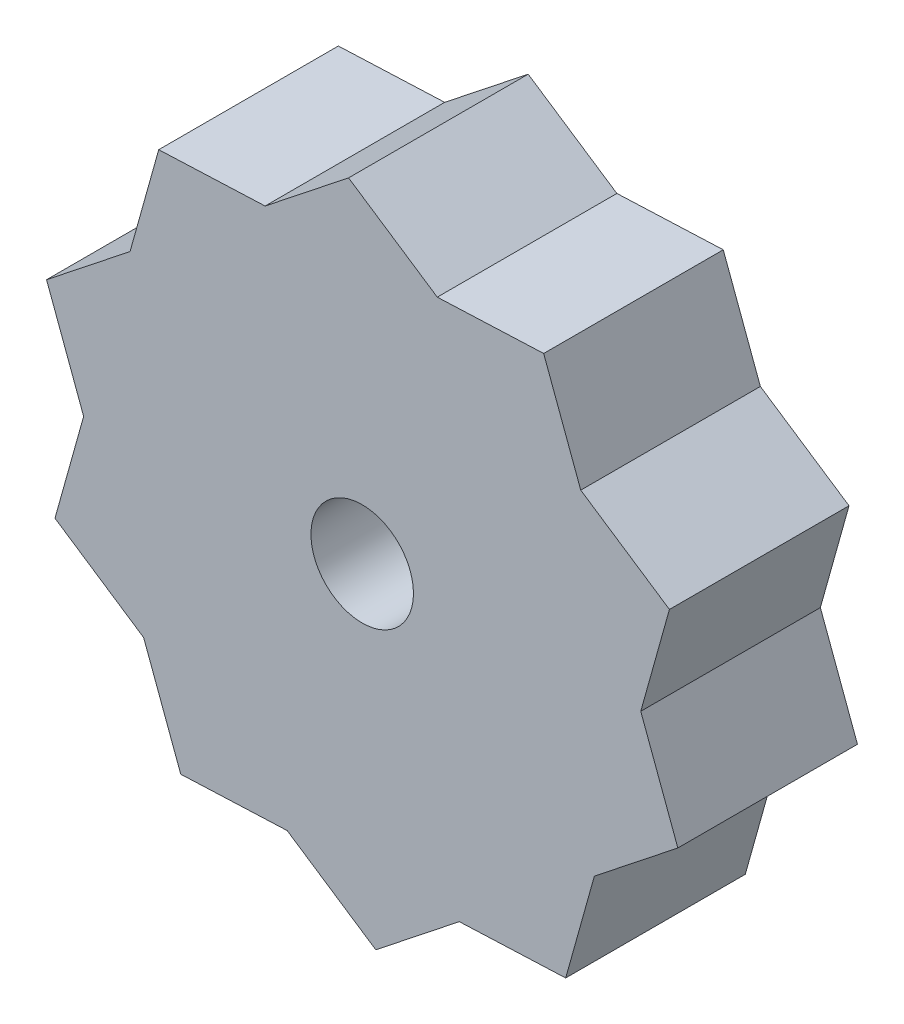
ISO-10303-21;
HEADER;
FILE_DESCRIPTION(('STEP AP214'),'2;1');
FILE_NAME('part.step','',(''),(''),'','','');
FILE_SCHEMA(('AUTOMOTIVE_DESIGN { 1 0 10303 214 1 1 1 1 }'));
ENDSEC;
DATA;
#1=APPLICATION_CONTEXT('core data for automotive mechanical design processes');
#2=APPLICATION_PROTOCOL_DEFINITION('international standard','automotive_design',2000,#1);
#3=PRODUCT_CONTEXT('',#1,'mechanical');
#4=PRODUCT('Part','Part','',(#3));
#5=PRODUCT_RELATED_PRODUCT_CATEGORY('part','',(#4));
#6=PRODUCT_DEFINITION_FORMATION('','',#4);
#7=PRODUCT_DEFINITION_CONTEXT('part definition',#1,'design');
#8=PRODUCT_DEFINITION('design','',#6,#7);
#9=PRODUCT_DEFINITION_SHAPE('','',#8);
#10=(LENGTH_UNIT() NAMED_UNIT(*) SI_UNIT(.MILLI.,.METRE.));
#11=(NAMED_UNIT(*) PLANE_ANGLE_UNIT() SI_UNIT($,.RADIAN.));
#12=(NAMED_UNIT(*) SI_UNIT($,.STERADIAN.) SOLID_ANGLE_UNIT());
#13=UNCERTAINTY_MEASURE_WITH_UNIT(LENGTH_MEASURE(1.E-05),#10,'distance_accuracy_value','');
#14=(GEOMETRIC_REPRESENTATION_CONTEXT(3) GLOBAL_UNCERTAINTY_ASSIGNED_CONTEXT((#13)) GLOBAL_UNIT_ASSIGNED_CONTEXT((#10,
#11,#12)) REPRESENTATION_CONTEXT('',''));
#15=CARTESIAN_POINT('',(0.,0.,0.));
#16=DIRECTION('',(0.,0.,1.));
#17=DIRECTION('',(1.,0.,0.));
#18=AXIS2_PLACEMENT_3D('',#15,#16,#17);
#19=CARTESIAN_POINT('',(0.,0.,0.));
#20=DIRECTION('',(0.,0.,1.));
#21=DIRECTION('',(1.,0.,0.));
#22=AXIS2_PLACEMENT_3D('',#19,#20,#21);
#23=PLANE('',#22);
#24=CARTESIAN_POINT('',(0.,0.,0.));
#25=DIRECTION('',(0.,0.,1.));
#26=DIRECTION('',(1.,0.,0.));
#27=AXIS2_PLACEMENT_3D('',#24,#25,#26);
#28=CIRCLE('',#27,1.45);
#29=CARTESIAN_POINT('',(1.45,0.,0.));
#30=VERTEX_POINT('',#29);
#31=EDGE_CURVE('E206',#30,#30,#28,.T.);
#32=ORIENTED_EDGE('',*,*,#31,.T.);
#33=EDGE_LOOP('',(#32));
#34=FACE_BOUND('',#33,.T.);
#35=DIRECTION('',(-0.783908535104401,-0.62087632310346,0.));
#36=VECTOR('',#35,1.);
#37=CARTESIAN_POINT('',(-4.65657242327595,5.87931401328301,0.));
#38=LINE('',#37,#36);
#39=CARTESIAN_POINT('',(-6.56687734652975,4.36630191602564,0.));
#40=VERTEX_POINT('',#39);
#41=CARTESIAN_POINT('',(-8.92814408942393,2.49611611303605,0.));
#42=VERTEX_POINT('',#41);
#43=EDGE_CURVE('E324',#40,#42,#38,.T.);
#44=ORIENTED_EDGE('',*,*,#43,.F.);
#45=DIRECTION('',(-0.269253380717237,-0.963069372876294,0.));
#46=VECTOR('',#45,1.);
#47=CARTESIAN_POINT('',(-7.22302029657221,2.01940035537928,0.));
#48=LINE('',#47,#46);
#49=CARTESIAN_POINT('',(-5.75584005732002,7.26723178148488,0.));
#50=VERTEX_POINT('',#49);
#51=EDGE_CURVE('E320',#50,#40,#48,.T.);
#52=ORIENTED_EDGE('',*,*,#51,.F.);
#53=DIRECTION('',(-0.999137273152821,-0.041529620715171,0.));
#54=VECTOR('',#53,1.);
#55=CARTESIAN_POINT('',(-0.311472155363783,7.49352954864616,0.));
#56=LINE('',#55,#54);
#57=CARTESIAN_POINT('',(-2.74626750002217,7.39232611054035,0.));
#58=VERTEX_POINT('',#57);
#59=EDGE_CURVE('E316',#58,#50,#56,.T.);
#60=ORIENTED_EDGE('',*,*,#59,.F.);
#61=DIRECTION('',(-0.783908535104401,-0.62087632310346,0.));
#62=VECTOR('',#61,1.);
#63=CARTESIAN_POINT('',(-4.65657242327595,5.87931401328301,0.));
#64=LINE('',#63,#62);
#65=CARTESIAN_POINT('',(-0.385000757127965,9.26251191352996,0.));
#66=VERTEX_POINT('',#65);
#67=EDGE_CURVE('E312',#66,#58,#64,.T.);
#68=ORIENTED_EDGE('',*,*,#67,.F.);
#69=DIRECTION('',(-0.832729532283751,0.553679985246429,0.));
#70=VECTOR('',#69,1.);
#71=CARTESIAN_POINT('',(4.15259988934822,6.24547149212813,0.));
#72=LINE('',#71,#70);
#73=CARTESIAN_POINT('',(2.12332318929464,7.59473298675197,0.));
#74=VERTEX_POINT('',#73);
#75=EDGE_CURVE('E308',#74,#66,#72,.T.);
#76=ORIENTED_EDGE('',*,*,#75,.F.);
#77=DIRECTION('',(-0.999137273152821,-0.041529620715171,0.));
#78=VECTOR('',#77,1.);
#79=CARTESIAN_POINT('',(-0.311472155363783,7.49352954864616,0.));
#80=LINE('',#79,#78);
#81=CARTESIAN_POINT('',(5.13289574659245,7.71982731580744,0.));
#82=VERTEX_POINT('',#81);
#83=EDGE_CURVE('E304',#82,#74,#80,.T.);
#84=ORIENTED_EDGE('',*,*,#83,.F.);
#85=DIRECTION('',(-0.348247413518095,0.937402655734427,0.));
#86=VECTOR('',#85,1.);
#87=CARTESIAN_POINT('',(7.03051991800819,2.61185560138571,0.));
#88=LINE('',#87,#86);
#89=CARTESIAN_POINT('',(6.18187658940173,4.89620999750433,0.));
#90=VERTEX_POINT('',#89);
#91=EDGE_CURVE('E300',#90,#82,#88,.T.);
#92=ORIENTED_EDGE('',*,*,#91,.F.);
#93=DIRECTION('',(-0.832729532283751,0.553679985246429,0.));
#94=VECTOR('',#93,1.);
#95=CARTESIAN_POINT('',(4.15259988934822,6.24547149212813,0.));
#96=LINE('',#95,#94);
#97=CARTESIAN_POINT('',(8.6902005358244,3.22843107072629,0.));
#98=VERTEX_POINT('',#97);
#99=EDGE_CURVE('E296',#98,#90,#96,.T.);
#100=ORIENTED_EDGE('',*,*,#99,.F.);
#101=DIRECTION('',(0.269253380717241,0.963069372876293,0.));
#102=VECTOR('',#101,1.);
#103=CARTESIAN_POINT('',(7.2230202965722,-2.0194003553793,0.));
#104=LINE('',#103,#102);
#105=CARTESIAN_POINT('',(7.87916324661466,0.327501205267048,0.));
#106=VERTEX_POINT('',#105);
#107=EDGE_CURVE('E292',#106,#98,#104,.T.);
#108=ORIENTED_EDGE('',*,*,#107,.F.);
#109=DIRECTION('',(-0.348247413518095,0.937402655734427,0.));
#110=VECTOR('',#109,1.);
#111=CARTESIAN_POINT('',(7.03051991800819,2.61185560138571,0.));
#112=LINE('',#111,#110);
#113=CARTESIAN_POINT('',(8.92814408942393,-2.49611611303602,0.));
#114=VERTEX_POINT('',#113);
#115=EDGE_CURVE('E288',#114,#106,#112,.T.);
#116=ORIENTED_EDGE('',*,*,#115,.F.);
#117=DIRECTION('',(0.783908535104399,0.620876323103463,0.));
#118=VECTOR('',#117,1.);
#119=CARTESIAN_POINT('',(4.65657242327597,-5.87931401328299,0.));
#120=LINE('',#119,#118);
#121=CARTESIAN_POINT('',(6.56687734652974,-4.36630191602564,0.));
#122=VERTEX_POINT('',#121);
#123=EDGE_CURVE('E284',#122,#114,#120,.T.);
#124=ORIENTED_EDGE('',*,*,#123,.F.);
#125=DIRECTION('',(0.269253380717241,0.963069372876293,0.));
#126=VECTOR('',#125,1.);
#127=CARTESIAN_POINT('',(7.2230202965722,-2.0194003553793,0.));
#128=LINE('',#127,#126);
#129=CARTESIAN_POINT('',(5.75584005732,-7.2672317814849,0.));
#130=VERTEX_POINT('',#129);
#131=EDGE_CURVE('E280',#130,#122,#128,.T.);
#132=ORIENTED_EDGE('',*,*,#131,.F.);
#133=DIRECTION('',(0.999137273152821,0.0415296207151665,0.));
#134=VECTOR('',#133,1.);
#135=CARTESIAN_POINT('',(0.311472155363748,-7.49352954864615,0.));
#136=LINE('',#135,#134);
#137=CARTESIAN_POINT('',(2.74626750002218,-7.39232611054036,0.));
#138=VERTEX_POINT('',#137);
#139=EDGE_CURVE('E276',#138,#130,#136,.T.);
#140=ORIENTED_EDGE('',*,*,#139,.F.);
#141=DIRECTION('',(0.783908535104399,0.620876323103463,0.));
#142=VECTOR('',#141,1.);
#143=CARTESIAN_POINT('',(4.65657242327597,-5.87931401328299,0.));
#144=LINE('',#143,#142);
#145=CARTESIAN_POINT('',(0.385000757128001,-9.26251191352997,0.));
#146=VERTEX_POINT('',#145);
#147=EDGE_CURVE('E273',#146,#138,#144,.T.);
#148=ORIENTED_EDGE('',*,*,#147,.F.);
#149=DIRECTION('',(0.832729532283753,-0.553679985246426,0.));
#150=VECTOR('',#149,1.);
#151=CARTESIAN_POINT('',(-4.1525998893482,-6.24547149212815,0.));
#152=LINE('',#151,#150);
#153=CARTESIAN_POINT('',(-2.12332318929466,-7.59473298675195,0.));
#154=VERTEX_POINT('',#153);
#155=EDGE_CURVE('E160',#154,#146,#152,.T.);
#156=ORIENTED_EDGE('',*,*,#155,.F.);
#157=DIRECTION('',(0.999137273152821,0.0415296207151665,0.));
#158=VECTOR('',#157,1.);
#159=CARTESIAN_POINT('',(-5.1328957465925,-7.71982731580741,0.));
#160=LINE('',#159,#158);
#161=CARTESIAN_POINT('',(-5.1328957465925,-7.71982731580741,0.));
#162=VERTEX_POINT('',#161);
#163=EDGE_CURVE('E153',#162,#154,#160,.T.);
#164=ORIENTED_EDGE('',*,*,#163,.F.);
#165=DIRECTION('',(0.348247413518091,-0.937402655734429,0.));
#166=VECTOR('',#165,1.);
#167=CARTESIAN_POINT('',(-8.92814408942393,2.49611611303605,0.));
#168=LINE('',#167,#166);
#169=CARTESIAN_POINT('',(-6.18187658940176,-4.89620999750433,0.));
#170=VERTEX_POINT('',#169);
#171=EDGE_CURVE('E144',#170,#162,#168,.T.);
#172=ORIENTED_EDGE('',*,*,#171,.F.);
#173=CARTESIAN_POINT('',(-8.69020053582439,-3.22843107072633,0.));
#174=VERTEX_POINT('',#173);
#175=EDGE_CURVE('E270',#174,#170,#152,.T.);
#176=ORIENTED_EDGE('',*,*,#175,.F.);
#177=DIRECTION('',(-0.269253380717237,-0.963069372876294,0.));
#178=VECTOR('',#177,1.);
#179=CARTESIAN_POINT('',(-7.22302029657221,2.01940035537928,0.));
#180=LINE('',#179,#178);
#181=CARTESIAN_POINT('',(-7.87916324661466,-0.327501205267067,0.));
#182=VERTEX_POINT('',#181);
#183=EDGE_CURVE('E196',#182,#174,#180,.T.);
#184=ORIENTED_EDGE('',*,*,#183,.F.);
#185=DIRECTION('',(0.348247413518091,-0.937402655734429,0.));
#186=VECTOR('',#185,1.);
#187=CARTESIAN_POINT('',(-7.03051991800822,-2.61185560138568,0.));
#188=LINE('',#187,#186);
#189=EDGE_CURVE('E202',#42,#182,#188,.T.);
#190=ORIENTED_EDGE('',*,*,#189,.F.);
#191=EDGE_LOOP('',(#44,#52,#60,#68,#76,#84,#92,#100,#108,#116,#124,#132,#140,#148,#156,#164,
#172,#176,#184,#190));
#192=FACE_BOUND('',#191,.T.);
#193=ADVANCED_FACE('F107',(#34,#192),#23,.F.);
#194=CARTESIAN_POINT('',(4.15259988934822,6.24547149212813,5.08));
#195=DIRECTION('',(-0.553679985246429,-0.832729532283751,0.));
#196=DIRECTION('',(0.832729532283751,-0.553679985246429,0.));
#197=AXIS2_PLACEMENT_3D('',#194,#195,#196);
#198=PLANE('',#197);
#199=ORIENTED_EDGE('',*,*,#99,.T.);
#200=DIRECTION('',(0.,0.,-1.));
#201=VECTOR('',#200,1.);
#202=CARTESIAN_POINT('',(6.18187658940173,4.89620999750433,5.08));
#203=LINE('',#202,#201);
#204=CARTESIAN_POINT('',(6.18187658940173,4.89620999750433,5.08));
#205=VERTEX_POINT('',#204);
#206=EDGE_CURVE('E366',#205,#90,#203,.T.);
#207=ORIENTED_EDGE('',*,*,#206,.F.);
#208=DIRECTION('',(-0.832729532283751,0.553679985246429,0.));
#209=VECTOR('',#208,1.);
#210=CARTESIAN_POINT('',(4.15259988934822,6.24547149212813,5.08));
#211=LINE('',#210,#209);
#212=CARTESIAN_POINT('',(8.6902005358244,3.22843107072629,5.08));
#213=VERTEX_POINT('',#212);
#214=EDGE_CURVE('E230',#213,#205,#211,.T.);
#215=ORIENTED_EDGE('',*,*,#214,.F.);
#216=DIRECTION('',(0.,0.,-1.));
#217=VECTOR('',#216,1.);
#218=CARTESIAN_POINT('',(8.6902005358244,3.22843107072629,5.08));
#219=LINE('',#218,#217);
#220=EDGE_CURVE('E370',#213,#98,#219,.T.);
#221=ORIENTED_EDGE('',*,*,#220,.T.);
#222=EDGE_LOOP('',(#199,#207,#215,#221));
#223=FACE_BOUND('',#222,.T.);
#224=ADVANCED_FACE('F432',(#223),#198,.F.);
#225=CARTESIAN_POINT('',(4.15259988934822,6.24547149212813,5.08));
#226=DIRECTION('',(-0.553679985246429,-0.832729532283751,0.));
#227=DIRECTION('',(0.832729532283751,-0.553679985246429,0.));
#228=AXIS2_PLACEMENT_3D('',#225,#226,#227);
#229=PLANE('',#228);
#230=ORIENTED_EDGE('',*,*,#75,.T.);
#231=DIRECTION('',(0.,0.,-1.));
#232=VECTOR('',#231,1.);
#233=CARTESIAN_POINT('',(-0.385000757127965,9.26251191352996,5.08));
#234=LINE('',#233,#232);
#235=CARTESIAN_POINT('',(-0.385000757127965,9.26251191352996,5.08));
#236=VERTEX_POINT('',#235);
#237=EDGE_CURVE('E354',#236,#66,#234,.T.);
#238=ORIENTED_EDGE('',*,*,#237,.F.);
#239=DIRECTION('',(-0.832729532283751,0.553679985246429,0.));
#240=VECTOR('',#239,1.);
#241=CARTESIAN_POINT('',(4.15259988934822,6.24547149212813,5.08));
#242=LINE('',#241,#240);
#243=CARTESIAN_POINT('',(2.12332318929464,7.59473298675197,5.08));
#244=VERTEX_POINT('',#243);
#245=EDGE_CURVE('E242',#244,#236,#242,.T.);
#246=ORIENTED_EDGE('',*,*,#245,.F.);
#247=DIRECTION('',(0.,0.,-1.));
#248=VECTOR('',#247,1.);
#249=CARTESIAN_POINT('',(2.12332318929464,7.59473298675197,5.08));
#250=LINE('',#249,#248);
#251=EDGE_CURVE('E358',#244,#74,#250,.T.);
#252=ORIENTED_EDGE('',*,*,#251,.T.);
#253=EDGE_LOOP('',(#230,#238,#246,#252));
#254=FACE_BOUND('',#253,.T.);
#255=ADVANCED_FACE('F454',(#254),#229,.F.);
#256=CARTESIAN_POINT('',(7.2230202965722,-2.0194003553793,5.08));
#257=DIRECTION('',(-0.963069372876293,0.269253380717241,0.));
#258=DIRECTION('',(-0.269253380717241,-0.963069372876293,0.));
#259=AXIS2_PLACEMENT_3D('',#256,#257,#258);
#260=PLANE('',#259);
#261=ORIENTED_EDGE('',*,*,#131,.T.);
#262=DIRECTION('',(0.,0.,-1.));
#263=VECTOR('',#262,1.);
#264=CARTESIAN_POINT('',(6.56687734652974,-4.36630191602564,5.08));
#265=LINE('',#264,#263);
#266=CARTESIAN_POINT('',(6.56687734652974,-4.36630191602564,5.08));
#267=VERTEX_POINT('',#266);
#268=EDGE_CURVE('E382',#267,#122,#265,.T.);
#269=ORIENTED_EDGE('',*,*,#268,.F.);
#270=DIRECTION('',(0.269253380717241,0.963069372876293,0.));
#271=VECTOR('',#270,1.);
#272=CARTESIAN_POINT('',(7.2230202965722,-2.0194003553793,5.08));
#273=LINE('',#272,#271);
#274=CARTESIAN_POINT('',(5.75584005732,-7.2672317814849,5.08));
#275=VERTEX_POINT('',#274);
#276=EDGE_CURVE('E214',#275,#267,#273,.T.);
#277=ORIENTED_EDGE('',*,*,#276,.F.);
#278=DIRECTION('',(0.,0.,-1.));
#279=VECTOR('',#278,1.);
#280=CARTESIAN_POINT('',(5.75584005732,-7.2672317814849,5.08));
#281=LINE('',#280,#279);
#282=EDGE_CURVE('E181',#275,#130,#281,.T.);
#283=ORIENTED_EDGE('',*,*,#282,.T.);
#284=EDGE_LOOP('',(#261,#269,#277,#283));
#285=FACE_BOUND('',#284,.T.);
#286=ADVANCED_FACE('F392',(#285),#260,.F.);
#287=CARTESIAN_POINT('',(7.2230202965722,-2.0194003553793,5.08));
#288=DIRECTION('',(-0.963069372876293,0.269253380717241,0.));
#289=DIRECTION('',(-0.269253380717241,-0.963069372876293,0.));
#290=AXIS2_PLACEMENT_3D('',#287,#288,#289);
#291=PLANE('',#290);
#292=ORIENTED_EDGE('',*,*,#107,.T.);
#293=ORIENTED_EDGE('',*,*,#220,.F.);
#294=DIRECTION('',(0.269253380717241,0.963069372876293,0.));
#295=VECTOR('',#294,1.);
#296=CARTESIAN_POINT('',(7.2230202965722,-2.0194003553793,5.08));
#297=LINE('',#296,#295);
#298=CARTESIAN_POINT('',(7.87916324661466,0.327501205267048,5.08));
#299=VERTEX_POINT('',#298);
#300=EDGE_CURVE('E226',#299,#213,#297,.T.);
#301=ORIENTED_EDGE('',*,*,#300,.F.);
#302=DIRECTION('',(0.,0.,-1.));
#303=VECTOR('',#302,1.);
#304=CARTESIAN_POINT('',(7.87916324661466,0.327501205267048,5.08));
#305=LINE('',#304,#303);
#306=EDGE_CURVE('E374',#299,#106,#305,.T.);
#307=ORIENTED_EDGE('',*,*,#306,.T.);
#308=EDGE_LOOP('',(#292,#293,#301,#307));
#309=FACE_BOUND('',#308,.T.);
#310=ADVANCED_FACE('F424',(#309),#291,.F.);
#311=CARTESIAN_POINT('',(0.311472155363748,-7.49352954864615,5.08));
#312=DIRECTION('',(-0.0415296207151665,0.999137273152821,0.));
#313=DIRECTION('',(-0.999137273152821,-0.0415296207151665,0.));
#314=AXIS2_PLACEMENT_3D('',#311,#312,#313);
#315=PLANE('',#314);
#316=ORIENTED_EDGE('',*,*,#139,.T.);
#317=ORIENTED_EDGE('',*,*,#282,.F.);
#318=DIRECTION('',(0.999137273152821,0.0415296207151665,0.));
#319=VECTOR('',#318,1.);
#320=CARTESIAN_POINT('',(0.311472155363748,-7.49352954864615,5.08));
#321=LINE('',#320,#319);
#322=CARTESIAN_POINT('',(2.74626750002218,-7.39232611054036,5.08));
#323=VERTEX_POINT('',#322);
#324=EDGE_CURVE('E210',#323,#275,#321,.T.);
#325=ORIENTED_EDGE('',*,*,#324,.F.);
#326=DIRECTION('',(0.,0.,-1.));
#327=VECTOR('',#326,1.);
#328=CARTESIAN_POINT('',(2.74626750002218,-7.39232611054036,5.08));
#329=LINE('',#328,#327);
#330=EDGE_CURVE('E173',#323,#138,#329,.T.);
#331=ORIENTED_EDGE('',*,*,#330,.T.);
#332=EDGE_LOOP('',(#316,#317,#325,#331));
#333=FACE_BOUND('',#332,.T.);
#334=ADVANCED_FACE('F530',(#333),#315,.F.);
#335=CARTESIAN_POINT('',(-7.03051991800822,-2.61185560138568,5.08));
#336=DIRECTION('',(0.937402655734429,0.348247413518091,0.));
#337=DIRECTION('',(-0.348247413518091,0.937402655734429,0.));
#338=AXIS2_PLACEMENT_3D('',#335,#336,#337);
#339=PLANE('',#338);
#340=ORIENTED_EDGE('',*,*,#189,.T.);
#341=DIRECTION('',(0.,0.,-1.));
#342=VECTOR('',#341,1.);
#343=CARTESIAN_POINT('',(-7.87916324661466,-0.327501205267067,5.08));
#344=LINE('',#343,#342);
#345=CARTESIAN_POINT('',(-7.87916324661466,-0.327501205267067,5.08));
#346=VERTEX_POINT('',#345);
#347=EDGE_CURVE('E334',#346,#182,#344,.T.);
#348=ORIENTED_EDGE('',*,*,#347,.F.);
#349=DIRECTION('',(0.348247413518091,-0.937402655734429,0.));
#350=VECTOR('',#349,1.);
#351=CARTESIAN_POINT('',(-7.03051991800822,-2.61185560138568,5.08));
#352=LINE('',#351,#350);
#353=CARTESIAN_POINT('',(-8.92814408942393,2.49611611303605,5.08));
#354=VERTEX_POINT('',#353);
#355=EDGE_CURVE('E261',#354,#346,#352,.T.);
#356=ORIENTED_EDGE('',*,*,#355,.F.);
#357=DIRECTION('',(0.,0.,-1.));
#358=VECTOR('',#357,1.);
#359=CARTESIAN_POINT('',(-8.92814408942393,2.49611611303605,5.08));
#360=LINE('',#359,#358);
#361=EDGE_CURVE('E338',#354,#42,#360,.T.);
#362=ORIENTED_EDGE('',*,*,#361,.T.);
#363=EDGE_LOOP('',(#340,#348,#356,#362));
#364=FACE_BOUND('',#363,.T.);
#365=ADVANCED_FACE('F495',(#364),#339,.F.);
#366=CARTESIAN_POINT('',(-4.65657242327595,5.87931401328301,5.08));
#367=DIRECTION('',(0.62087632310346,-0.783908535104401,0.));
#368=DIRECTION('',(0.783908535104401,0.62087632310346,0.));
#369=AXIS2_PLACEMENT_3D('',#366,#367,#368);
#370=PLANE('',#369);
#371=ORIENTED_EDGE('',*,*,#67,.T.);
#372=DIRECTION('',(0.,0.,-1.));
#373=VECTOR('',#372,1.);
#374=CARTESIAN_POINT('',(-2.74626750002217,7.39232611054035,5.08));
#375=LINE('',#374,#373);
#376=CARTESIAN_POINT('',(-2.74626750002217,7.39232611054035,5.08));
#377=VERTEX_POINT('',#376);
#378=EDGE_CURVE('E350',#377,#58,#375,.T.);
#379=ORIENTED_EDGE('',*,*,#378,.F.);
#380=DIRECTION('',(-0.783908535104401,-0.62087632310346,0.));
#381=VECTOR('',#380,1.);
#382=CARTESIAN_POINT('',(-4.65657242327595,5.87931401328301,5.08));
#383=LINE('',#382,#381);
#384=EDGE_CURVE('E246',#236,#377,#383,.T.);
#385=ORIENTED_EDGE('',*,*,#384,.F.);
#386=ORIENTED_EDGE('',*,*,#237,.T.);
#387=EDGE_LOOP('',(#371,#379,#385,#386));
#388=FACE_BOUND('',#387,.T.);
#389=ADVANCED_FACE('F464',(#388),#370,.F.);
#390=CARTESIAN_POINT('',(-4.65657242327595,5.87931401328301,5.08));
#391=DIRECTION('',(0.62087632310346,-0.783908535104401,0.));
#392=DIRECTION('',(0.783908535104401,0.62087632310346,0.));
#393=AXIS2_PLACEMENT_3D('',#390,#391,#392);
#394=PLANE('',#393);
#395=ORIENTED_EDGE('',*,*,#43,.T.);
#396=ORIENTED_EDGE('',*,*,#361,.F.);
#397=DIRECTION('',(-0.783908535104401,-0.62087632310346,0.));
#398=VECTOR('',#397,1.);
#399=CARTESIAN_POINT('',(-4.65657242327595,5.87931401328301,5.08));
#400=LINE('',#399,#398);
#401=CARTESIAN_POINT('',(-6.56687734652975,4.36630191602564,5.08));
#402=VERTEX_POINT('',#401);
#403=EDGE_CURVE('E257',#402,#354,#400,.T.);
#404=ORIENTED_EDGE('',*,*,#403,.F.);
#405=DIRECTION('',(0.,0.,-1.));
#406=VECTOR('',#405,1.);
#407=CARTESIAN_POINT('',(-6.56687734652975,4.36630191602564,5.08));
#408=LINE('',#407,#406);
#409=EDGE_CURVE('E342',#402,#40,#408,.T.);
#410=ORIENTED_EDGE('',*,*,#409,.T.);
#411=EDGE_LOOP('',(#395,#396,#404,#410));
#412=FACE_BOUND('',#411,.T.);
#413=ADVANCED_FACE('F486',(#412),#394,.F.);
#414=CARTESIAN_POINT('',(0.,0.,5.08));
#415=DIRECTION('',(0.,0.,1.));
#416=DIRECTION('',(1.,0.,0.));
#417=AXIS2_PLACEMENT_3D('',#414,#415,#416);
#418=PLANE('',#417);
#419=CARTESIAN_POINT('',(0.,0.,5.08));
#420=DIRECTION('',(0.,0.,1.));
#421=DIRECTION('',(1.,0.,0.));
#422=AXIS2_PLACEMENT_3D('',#419,#420,#421);
#423=CIRCLE('',#422,1.45);
#424=CARTESIAN_POINT('',(1.45,0.,5.08));
#425=VERTEX_POINT('',#424);
#426=EDGE_CURVE('E154',#425,#425,#423,.T.);
#427=ORIENTED_EDGE('',*,*,#426,.F.);
#428=EDGE_LOOP('',(#427));
#429=FACE_BOUND('',#428,.T.);
#430=ORIENTED_EDGE('',*,*,#384,.T.);
#431=DIRECTION('',(-0.999137273152821,-0.041529620715171,0.));
#432=VECTOR('',#431,1.);
#433=CARTESIAN_POINT('',(-0.311472155363783,7.49352954864616,5.08));
#434=LINE('',#433,#432);
#435=CARTESIAN_POINT('',(-5.75584005732002,7.26723178148488,5.08));
#436=VERTEX_POINT('',#435);
#437=EDGE_CURVE('E249',#377,#436,#434,.T.);
#438=ORIENTED_EDGE('',*,*,#437,.T.);
#439=DIRECTION('',(-0.269253380717237,-0.963069372876294,0.));
#440=VECTOR('',#439,1.);
#441=CARTESIAN_POINT('',(-7.22302029657221,2.01940035537928,5.08));
#442=LINE('',#441,#440);
#443=EDGE_CURVE('E253',#436,#402,#442,.T.);
#444=ORIENTED_EDGE('',*,*,#443,.T.);
#445=ORIENTED_EDGE('',*,*,#403,.T.);
#446=ORIENTED_EDGE('',*,*,#355,.T.);
#447=DIRECTION('',(-0.269253380717237,-0.963069372876294,0.));
#448=VECTOR('',#447,1.);
#449=CARTESIAN_POINT('',(-7.22302029657221,2.01940035537928,5.08));
#450=LINE('',#449,#448);
#451=CARTESIAN_POINT('',(-8.69020053582439,-3.22843107072633,5.08));
#452=VERTEX_POINT('',#451);
#453=EDGE_CURVE('E265',#346,#452,#450,.T.);
#454=ORIENTED_EDGE('',*,*,#453,.T.);
#455=DIRECTION('',(0.832729532283753,-0.553679985246426,0.));
#456=VECTOR('',#455,1.);
#457=CARTESIAN_POINT('',(-4.1525998893482,-6.24547149212815,5.08));
#458=LINE('',#457,#456);
#459=CARTESIAN_POINT('',(-6.18187658940176,-4.89620999750433,5.08));
#460=VERTEX_POINT('',#459);
#461=EDGE_CURVE('E195',#452,#460,#458,.T.);
#462=ORIENTED_EDGE('',*,*,#461,.T.);
#463=DIRECTION('',(0.348247413518091,-0.937402655734429,0.));
#464=VECTOR('',#463,1.);
#465=CARTESIAN_POINT('',(-8.92814408942393,2.49611611303605,5.08));
#466=LINE('',#465,#464);
#467=CARTESIAN_POINT('',(-5.1328957465925,-7.71982731580741,5.08));
#468=VERTEX_POINT('',#467);
#469=EDGE_CURVE('E136',#460,#468,#466,.T.);
#470=ORIENTED_EDGE('',*,*,#469,.T.);
#471=DIRECTION('',(0.999137273152821,0.0415296207151665,0.));
#472=VECTOR('',#471,1.);
#473=CARTESIAN_POINT('',(-5.1328957465925,-7.71982731580741,5.08));
#474=LINE('',#473,#472);
#475=CARTESIAN_POINT('',(-2.12332318929466,-7.59473298675195,5.08));
#476=VERTEX_POINT('',#475);
#477=EDGE_CURVE('E158',#468,#476,#474,.T.);
#478=ORIENTED_EDGE('',*,*,#477,.T.);
#479=CARTESIAN_POINT('',(0.385000757128001,-9.26251191352997,5.08));
#480=VERTEX_POINT('',#479);
#481=EDGE_CURVE('E191',#476,#480,#458,.T.);
#482=ORIENTED_EDGE('',*,*,#481,.T.);
#483=DIRECTION('',(0.783908535104399,0.620876323103463,0.));
#484=VECTOR('',#483,1.);
#485=CARTESIAN_POINT('',(4.65657242327597,-5.87931401328299,5.08));
#486=LINE('',#485,#484);
#487=EDGE_CURVE('E200',#480,#323,#486,.T.);
#488=ORIENTED_EDGE('',*,*,#487,.T.);
#489=ORIENTED_EDGE('',*,*,#324,.T.);
#490=ORIENTED_EDGE('',*,*,#276,.T.);
#491=DIRECTION('',(0.783908535104399,0.620876323103463,0.));
#492=VECTOR('',#491,1.);
#493=CARTESIAN_POINT('',(4.65657242327597,-5.87931401328299,5.08));
#494=LINE('',#493,#492);
#495=CARTESIAN_POINT('',(8.92814408942393,-2.49611611303602,5.08));
#496=VERTEX_POINT('',#495);
#497=EDGE_CURVE('E218',#267,#496,#494,.T.);
#498=ORIENTED_EDGE('',*,*,#497,.T.);
#499=DIRECTION('',(-0.348247413518095,0.937402655734427,0.));
#500=VECTOR('',#499,1.);
#501=CARTESIAN_POINT('',(7.03051991800819,2.61185560138571,5.08));
#502=LINE('',#501,#500);
#503=EDGE_CURVE('E222',#496,#299,#502,.T.);
#504=ORIENTED_EDGE('',*,*,#503,.T.);
#505=ORIENTED_EDGE('',*,*,#300,.T.);
#506=ORIENTED_EDGE('',*,*,#214,.T.);
#507=DIRECTION('',(-0.348247413518095,0.937402655734427,0.));
#508=VECTOR('',#507,1.);
#509=CARTESIAN_POINT('',(7.03051991800819,2.61185560138571,5.08));
#510=LINE('',#509,#508);
#511=CARTESIAN_POINT('',(5.13289574659245,7.71982731580744,5.08));
#512=VERTEX_POINT('',#511);
#513=EDGE_CURVE('E234',#205,#512,#510,.T.);
#514=ORIENTED_EDGE('',*,*,#513,.T.);
#515=DIRECTION('',(-0.999137273152821,-0.041529620715171,0.));
#516=VECTOR('',#515,1.);
#517=CARTESIAN_POINT('',(-0.311472155363783,7.49352954864616,5.08));
#518=LINE('',#517,#516);
#519=EDGE_CURVE('E238',#512,#244,#518,.T.);
#520=ORIENTED_EDGE('',*,*,#519,.T.);
#521=ORIENTED_EDGE('',*,*,#245,.T.);
#522=EDGE_LOOP('',(#430,#438,#444,#445,#446,#454,#462,#470,#478,#482,#488,#489,#490,#498,#504,
#505,#506,#514,#520,#521));
#523=FACE_BOUND('',#522,.T.);
#524=ADVANCED_FACE('F188',(#429,#523),#418,.T.);
#525=CARTESIAN_POINT('',(7.03051991800819,2.61185560138571,5.08));
#526=DIRECTION('',(-0.937402655734427,-0.348247413518095,0.));
#527=DIRECTION('',(0.348247413518095,-0.937402655734427,0.));
#528=AXIS2_PLACEMENT_3D('',#525,#526,#527);
#529=PLANE('',#528);
#530=ORIENTED_EDGE('',*,*,#91,.T.);
#531=DIRECTION('',(0.,0.,-1.));
#532=VECTOR('',#531,1.);
#533=CARTESIAN_POINT('',(5.13289574659245,7.71982731580744,5.08));
#534=LINE('',#533,#532);
#535=EDGE_CURVE('E362',#512,#82,#534,.T.);
#536=ORIENTED_EDGE('',*,*,#535,.F.);
#537=ORIENTED_EDGE('',*,*,#513,.F.);
#538=ORIENTED_EDGE('',*,*,#206,.T.);
#539=EDGE_LOOP('',(#530,#536,#537,#538));
#540=FACE_BOUND('',#539,.T.);
#541=ADVANCED_FACE('F438',(#540),#529,.F.);
#542=CARTESIAN_POINT('',(-0.311472155363783,7.49352954864616,5.08));
#543=DIRECTION('',(0.041529620715171,-0.999137273152821,0.));
#544=DIRECTION('',(0.999137273152821,0.041529620715171,0.));
#545=AXIS2_PLACEMENT_3D('',#542,#543,#544);
#546=PLANE('',#545);
#547=ORIENTED_EDGE('',*,*,#83,.T.);
#548=ORIENTED_EDGE('',*,*,#251,.F.);
#549=ORIENTED_EDGE('',*,*,#519,.F.);
#550=ORIENTED_EDGE('',*,*,#535,.T.);
#551=EDGE_LOOP('',(#547,#548,#549,#550));
#552=FACE_BOUND('',#551,.T.);
#553=ADVANCED_FACE('F448',(#552),#546,.F.);
#554=CARTESIAN_POINT('',(4.65657242327597,-5.87931401328299,5.08));
#555=DIRECTION('',(-0.620876323103463,0.783908535104399,0.));
#556=DIRECTION('',(-0.783908535104399,-0.620876323103463,0.));
#557=AXIS2_PLACEMENT_3D('',#554,#555,#556);
#558=PLANE('',#557);
#559=ORIENTED_EDGE('',*,*,#123,.T.);
#560=DIRECTION('',(0.,0.,-1.));
#561=VECTOR('',#560,1.);
#562=CARTESIAN_POINT('',(8.92814408942393,-2.49611611303602,5.08));
#563=LINE('',#562,#561);
#564=EDGE_CURVE('E378',#496,#114,#563,.T.);
#565=ORIENTED_EDGE('',*,*,#564,.F.);
#566=ORIENTED_EDGE('',*,*,#497,.F.);
#567=ORIENTED_EDGE('',*,*,#268,.T.);
#568=EDGE_LOOP('',(#559,#565,#566,#567));
#569=FACE_BOUND('',#568,.T.);
#570=ADVANCED_FACE('F407',(#569),#558,.F.);
#571=CARTESIAN_POINT('',(7.03051991800819,2.61185560138571,5.08));
#572=DIRECTION('',(-0.937402655734427,-0.348247413518095,0.));
#573=DIRECTION('',(0.348247413518095,-0.937402655734427,0.));
#574=AXIS2_PLACEMENT_3D('',#571,#572,#573);
#575=PLANE('',#574);
#576=ORIENTED_EDGE('',*,*,#115,.T.);
#577=ORIENTED_EDGE('',*,*,#306,.F.);
#578=ORIENTED_EDGE('',*,*,#503,.F.);
#579=ORIENTED_EDGE('',*,*,#564,.T.);
#580=EDGE_LOOP('',(#576,#577,#578,#579));
#581=FACE_BOUND('',#580,.T.);
#582=ADVANCED_FACE('F414',(#581),#575,.F.);
#583=CARTESIAN_POINT('',(-4.1525998893482,-6.24547149212815,5.08));
#584=DIRECTION('',(0.553679985246426,0.832729532283753,0.));
#585=DIRECTION('',(-0.832729532283753,0.553679985246426,0.));
#586=AXIS2_PLACEMENT_3D('',#583,#584,#585);
#587=PLANE('',#586);
#588=DIRECTION('',(0.,0.,1.));
#589=VECTOR('',#588,1.);
#590=CARTESIAN_POINT('',(-2.12332318929466,-7.59473298675195,5.08));
#591=LINE('',#590,#589);
#592=EDGE_CURVE('E117',#154,#476,#591,.T.);
#593=ORIENTED_EDGE('',*,*,#592,.F.);
#594=ORIENTED_EDGE('',*,*,#155,.T.);
#595=DIRECTION('',(0.,0.,-1.));
#596=VECTOR('',#595,1.);
#597=CARTESIAN_POINT('',(0.385000757128001,-9.26251191352997,5.08));
#598=LINE('',#597,#596);
#599=EDGE_CURVE('E170',#480,#146,#598,.T.);
#600=ORIENTED_EDGE('',*,*,#599,.F.);
#601=ORIENTED_EDGE('',*,*,#481,.F.);
#602=EDGE_LOOP('',(#593,#594,#600,#601));
#603=FACE_BOUND('',#602,.T.);
#604=ADVANCED_FACE('F193',(#603),#587,.F.);
#605=CARTESIAN_POINT('',(4.65657242327597,-5.87931401328299,5.08));
#606=DIRECTION('',(-0.620876323103463,0.783908535104399,0.));
#607=DIRECTION('',(-0.783908535104399,-0.620876323103463,0.));
#608=AXIS2_PLACEMENT_3D('',#605,#606,#607);
#609=PLANE('',#608);
#610=ORIENTED_EDGE('',*,*,#147,.T.);
#611=ORIENTED_EDGE('',*,*,#330,.F.);
#612=ORIENTED_EDGE('',*,*,#487,.F.);
#613=ORIENTED_EDGE('',*,*,#599,.T.);
#614=EDGE_LOOP('',(#610,#611,#612,#613));
#615=FACE_BOUND('',#614,.T.);
#616=ADVANCED_FACE('F529',(#615),#609,.F.);
#617=CARTESIAN_POINT('',(-7.22302029657221,2.01940035537928,5.08));
#618=DIRECTION('',(0.963069372876294,-0.269253380717237,0.));
#619=DIRECTION('',(0.269253380717237,0.963069372876294,0.));
#620=AXIS2_PLACEMENT_3D('',#617,#618,#619);
#621=PLANE('',#620);
#622=ORIENTED_EDGE('',*,*,#183,.T.);
#623=DIRECTION('',(0.,0.,-1.));
#624=VECTOR('',#623,1.);
#625=CARTESIAN_POINT('',(-8.69020053582439,-3.22843107072633,5.08));
#626=LINE('',#625,#624);
#627=EDGE_CURVE('E269',#452,#174,#626,.T.);
#628=ORIENTED_EDGE('',*,*,#627,.F.);
#629=ORIENTED_EDGE('',*,*,#453,.F.);
#630=ORIENTED_EDGE('',*,*,#347,.T.);
#631=EDGE_LOOP('',(#622,#628,#629,#630));
#632=FACE_BOUND('',#631,.T.);
#633=ADVANCED_FACE('F501',(#632),#621,.F.);
#634=DIRECTION('',(0.,0.,-1.));
#635=VECTOR('',#634,1.);
#636=CARTESIAN_POINT('',(-6.18187658940176,-4.89620999750433,5.08));
#637=LINE('',#636,#635);
#638=EDGE_CURVE('E12',#460,#170,#637,.T.);
#639=ORIENTED_EDGE('',*,*,#638,.F.);
#640=ORIENTED_EDGE('',*,*,#461,.F.);
#641=ORIENTED_EDGE('',*,*,#627,.T.);
#642=ORIENTED_EDGE('',*,*,#175,.T.);
#643=EDGE_LOOP('',(#639,#640,#641,#642));
#644=FACE_BOUND('',#643,.T.);
#645=ADVANCED_FACE('F508',(#644),#587,.F.);
#646=CARTESIAN_POINT('',(-0.311472155363783,7.49352954864616,5.08));
#647=DIRECTION('',(0.041529620715171,-0.999137273152821,0.));
#648=DIRECTION('',(0.999137273152821,0.041529620715171,0.));
#649=AXIS2_PLACEMENT_3D('',#646,#647,#648);
#650=PLANE('',#649);
#651=ORIENTED_EDGE('',*,*,#59,.T.);
#652=DIRECTION('',(0.,0.,-1.));
#653=VECTOR('',#652,1.);
#654=CARTESIAN_POINT('',(-5.75584005732002,7.26723178148488,5.08));
#655=LINE('',#654,#653);
#656=EDGE_CURVE('E346',#436,#50,#655,.T.);
#657=ORIENTED_EDGE('',*,*,#656,.F.);
#658=ORIENTED_EDGE('',*,*,#437,.F.);
#659=ORIENTED_EDGE('',*,*,#378,.T.);
#660=EDGE_LOOP('',(#651,#657,#658,#659));
#661=FACE_BOUND('',#660,.T.);
#662=ADVANCED_FACE('F470',(#661),#650,.F.);
#663=CARTESIAN_POINT('',(-7.22302029657221,2.01940035537928,5.08));
#664=DIRECTION('',(0.963069372876294,-0.269253380717237,0.));
#665=DIRECTION('',(0.269253380717237,0.963069372876294,0.));
#666=AXIS2_PLACEMENT_3D('',#663,#664,#665);
#667=PLANE('',#666);
#668=ORIENTED_EDGE('',*,*,#51,.T.);
#669=ORIENTED_EDGE('',*,*,#409,.F.);
#670=ORIENTED_EDGE('',*,*,#443,.F.);
#671=ORIENTED_EDGE('',*,*,#656,.T.);
#672=EDGE_LOOP('',(#668,#669,#670,#671));
#673=FACE_BOUND('',#672,.T.);
#674=ADVANCED_FACE('F480',(#673),#667,.F.);
#675=CARTESIAN_POINT('',(-5.1328957465925,-7.71982731580741,5.08));
#676=DIRECTION('',(-0.0415296207151665,0.999137273152821,0.));
#677=DIRECTION('',(-0.999137273152821,-0.0415296207151665,0.));
#678=AXIS2_PLACEMENT_3D('',#675,#676,#677);
#679=PLANE('',#678);
#680=ORIENTED_EDGE('',*,*,#163,.T.);
#681=ORIENTED_EDGE('',*,*,#592,.T.);
#682=ORIENTED_EDGE('',*,*,#477,.F.);
#683=DIRECTION('',(0.,0.,-1.));
#684=VECTOR('',#683,1.);
#685=CARTESIAN_POINT('',(-5.1328957465925,-7.71982731580741,5.08));
#686=LINE('',#685,#684);
#687=EDGE_CURVE('E146',#468,#162,#686,.T.);
#688=ORIENTED_EDGE('',*,*,#687,.T.);
#689=EDGE_LOOP('',(#680,#681,#682,#688));
#690=FACE_BOUND('',#689,.T.);
#691=ADVANCED_FACE('F156',(#690),#679,.F.);
#692=CARTESIAN_POINT('',(-8.92814408942393,2.49611611303605,5.08));
#693=DIRECTION('',(0.937402655734429,0.348247413518091,0.));
#694=DIRECTION('',(-0.348247413518091,0.937402655734429,0.));
#695=AXIS2_PLACEMENT_3D('',#692,#693,#694);
#696=PLANE('',#695);
#697=ORIENTED_EDGE('',*,*,#469,.F.);
#698=ORIENTED_EDGE('',*,*,#638,.T.);
#699=ORIENTED_EDGE('',*,*,#171,.T.);
#700=ORIENTED_EDGE('',*,*,#687,.F.);
#701=EDGE_LOOP('',(#697,#698,#699,#700));
#702=FACE_BOUND('',#701,.T.);
#703=ADVANCED_FACE('F109',(#702),#696,.F.);
#704=CARTESIAN_POINT('',(0.,0.,5.08));
#705=DIRECTION('',(0.,0.,-1.));
#706=DIRECTION('',(-1.,0.,0.));
#707=AXIS2_PLACEMENT_3D('',#704,#705,#706);
#708=CYLINDRICAL_SURFACE('',#707,1.45);
#709=ORIENTED_EDGE('',*,*,#426,.T.);
#710=EDGE_LOOP('',(#709));
#711=FACE_BOUND('',#710,.T.);
#712=ORIENTED_EDGE('',*,*,#31,.F.);
#713=EDGE_LOOP('',(#712));
#714=FACE_BOUND('',#713,.T.);
#715=ADVANCED_FACE('F687',(#711,#714),#708,.F.);
#716=CLOSED_SHELL('',(#193,#224,#255,#286,#310,#334,#365,#389,#413,#524,#541,#553,#570,#582,
#604,#616,#633,#645,#662,#674,#691,#703,#715));
#717=MANIFOLD_SOLID_BREP('B2',#716);
#718=ADVANCED_BREP_SHAPE_REPRESENTATION('',(#18,#717),#14);
#719=SHAPE_DEFINITION_REPRESENTATION(#9,#718);
ENDSEC;
END-ISO-10303-21;
